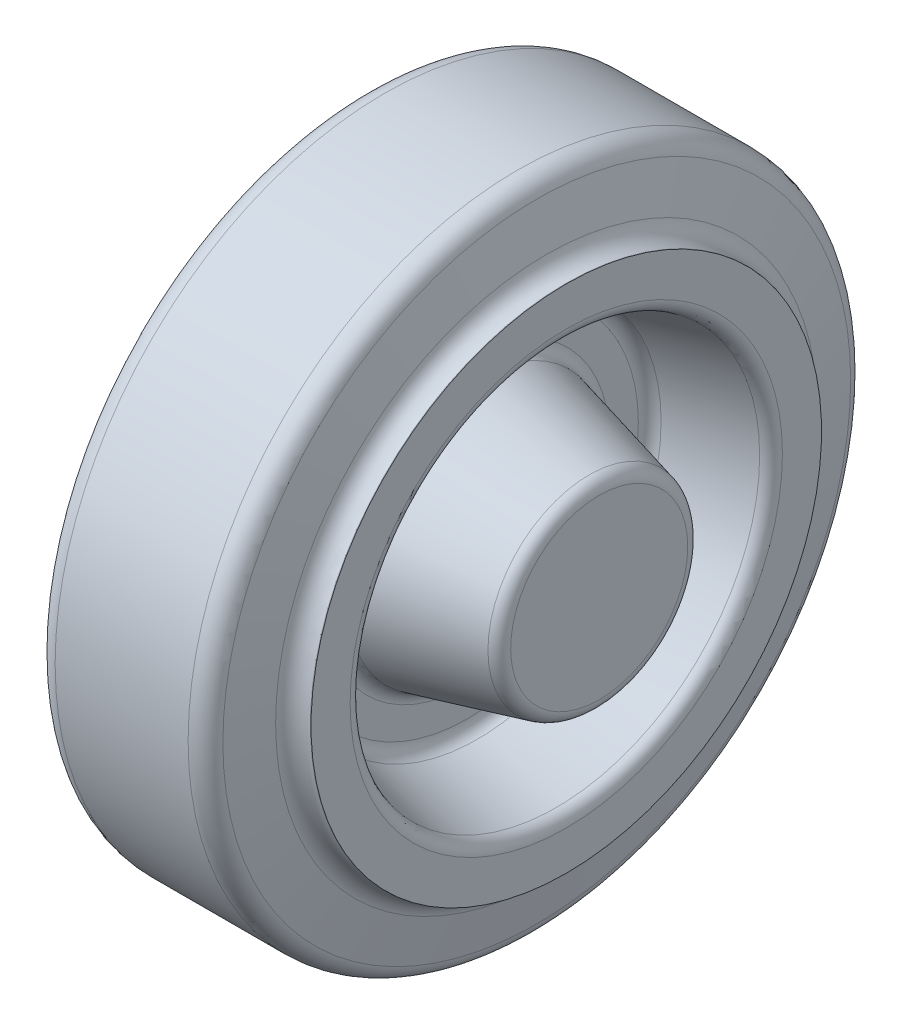
ISO-10303-21;
HEADER;
FILE_DESCRIPTION(('STEP AP214'),'2;1');
FILE_NAME('part.step','',(''),(''),'','','');
FILE_SCHEMA(('AUTOMOTIVE_DESIGN { 1 0 10303 214 1 1 1 1 }'));
ENDSEC;
DATA;
#1=APPLICATION_CONTEXT('core data for automotive mechanical design processes');
#2=APPLICATION_PROTOCOL_DEFINITION('international standard','automotive_design',2000,#1);
#3=PRODUCT_CONTEXT('',#1,'mechanical');
#4=PRODUCT('Part','Part','',(#3));
#5=PRODUCT_RELATED_PRODUCT_CATEGORY('part','',(#4));
#6=PRODUCT_DEFINITION_FORMATION('','',#4);
#7=PRODUCT_DEFINITION_CONTEXT('part definition',#1,'design');
#8=PRODUCT_DEFINITION('design','',#6,#7);
#9=PRODUCT_DEFINITION_SHAPE('','',#8);
#10=(LENGTH_UNIT() NAMED_UNIT(*) SI_UNIT(.MILLI.,.METRE.));
#11=(NAMED_UNIT(*) PLANE_ANGLE_UNIT() SI_UNIT($,.RADIAN.));
#12=(NAMED_UNIT(*) SI_UNIT($,.STERADIAN.) SOLID_ANGLE_UNIT());
#13=UNCERTAINTY_MEASURE_WITH_UNIT(LENGTH_MEASURE(1.E-05),#10,'distance_accuracy_value','');
#14=(GEOMETRIC_REPRESENTATION_CONTEXT(3) GLOBAL_UNCERTAINTY_ASSIGNED_CONTEXT((#13)) GLOBAL_UNIT_ASSIGNED_CONTEXT((#10,
#11,#12)) REPRESENTATION_CONTEXT('',''));
#15=CARTESIAN_POINT('',(0.,0.,0.));
#16=DIRECTION('',(0.,0.,1.));
#17=DIRECTION('',(1.,0.,0.));
#18=AXIS2_PLACEMENT_3D('',#15,#16,#17);
#19=CARTESIAN_POINT('',(-22.4999999999989,-4.44089209850063E-13,0.));
#20=DIRECTION('',(-1.,0.,0.));
#21=DIRECTION('',(0.,-1.,0.));
#22=AXIS2_PLACEMENT_3D('',#19,#20,#21);
#23=PLANE('',#22);
#24=CARTESIAN_POINT('',(-22.5000000000002,-8.88122908548894E-13,1.11022302462516E-13));
#25=DIRECTION('',(1.,0.,0.));
#26=DIRECTION('',(0.,0.,-1.));
#27=AXIS2_PLACEMENT_3D('',#24,#25,#26);
#28=CIRCLE('',#27,13.4384471871913);
#29=CARTESIAN_POINT('',(-22.4999999999997,-5.76108851248636E-13,-13.4384471871911));
#30=VERTEX_POINT('',#29);
#31=CARTESIAN_POINT('',(-22.4999999999997,-7.10509429069363E-13,13.4384471871912));
#32=VERTEX_POINT('',#31);
#33=EDGE_CURVE('E86',#30,#32,#28,.T.);
#34=ORIENTED_EDGE('',*,*,#33,.F.);
#35=CARTESIAN_POINT('',(-22.5000000000002,-8.88122908548894E-13,1.11022302462516E-13));
#36=DIRECTION('',(1.,0.,0.));
#37=DIRECTION('',(0.,0.,1.));
#38=AXIS2_PLACEMENT_3D('',#35,#36,#37);
#39=CIRCLE('',#38,13.438447187191);
#40=EDGE_CURVE('E82',#32,#30,#39,.T.);
#41=ORIENTED_EDGE('',*,*,#40,.F.);
#42=EDGE_LOOP('',(#34,#41));
#43=FACE_BOUND('',#42,.T.);
#44=ADVANCED_FACE('F17',(#43),#23,.T.);
#45=CARTESIAN_POINT('',(22.5000000000001,3.33066907387547E-13,0.));
#46=DIRECTION('',(1.,0.,0.));
#47=DIRECTION('',(0.,1.,0.));
#48=AXIS2_PLACEMENT_3D('',#45,#46,#47);
#49=PLANE('',#48);
#50=CARTESIAN_POINT('',(22.5000000000009,-7.77211628388841E-13,0.));
#51=DIRECTION('',(-1.,0.,0.));
#52=DIRECTION('',(0.,0.,1.));
#53=AXIS2_PLACEMENT_3D('',#50,#51,#52);
#54=CIRCLE('',#53,13.4384471871912);
#55=CARTESIAN_POINT('',(22.5000000000006,-3.88792023770767E-13,13.4384471871912));
#56=VERTEX_POINT('',#55);
#57=CARTESIAN_POINT('',(22.5000000000006,-3.33100214078284E-13,-13.4384471871911));
#58=VERTEX_POINT('',#57);
#59=EDGE_CURVE('E126',#56,#58,#54,.T.);
#60=ORIENTED_EDGE('',*,*,#59,.F.);
#61=CARTESIAN_POINT('',(22.5000000000009,-7.77211628388841E-13,0.));
#62=DIRECTION('',(-1.,0.,0.));
#63=DIRECTION('',(0.,0.,-1.));
#64=AXIS2_PLACEMENT_3D('',#61,#62,#63);
#65=CIRCLE('',#64,13.4384471871911);
#66=EDGE_CURVE('E93',#58,#56,#65,.T.);
#67=ORIENTED_EDGE('',*,*,#66,.F.);
#68=EDGE_LOOP('',(#60,#67));
#69=FACE_BOUND('',#68,.T.);
#70=ADVANCED_FACE('F112',(#69),#49,.T.);
#71=CARTESIAN_POINT('',(-20.5000000000002,-8.88178419700125E-13,1.11022302462516E-13));
#72=DIRECTION('',(-1.,0.,0.));
#73=DIRECTION('',(0.,0.,1.));
#74=AXIS2_PLACEMENT_3D('',#71,#72,#73);
#75=TOROIDAL_SURFACE('',#74,13.4384471871912,2.);
#76=ORIENTED_EDGE('',*,*,#40,.T.);
#77=ORIENTED_EDGE('',*,*,#33,.T.);
#78=EDGE_LOOP('',(#76,#77));
#79=FACE_BOUND('',#78,.T.);
#80=CARTESIAN_POINT('',(-20.9850712500731,0.,0.));
#81=DIRECTION('',(1.,0.,0.));
#82=DIRECTION('',(0.,0.,-1.));
#83=AXIS2_PLACEMENT_3D('',#80,#81,#82);
#84=CIRCLE('',#83,15.3787321874813);
#85=CARTESIAN_POINT('',(-20.9850712500731,0.,-15.3787321874813));
#86=VERTEX_POINT('',#85);
#87=EDGE_CURVE('E121',#86,#86,#84,.T.);
#88=ORIENTED_EDGE('',*,*,#87,.F.);
#89=EDGE_LOOP('',(#88));
#90=FACE_BOUND('',#89,.T.);
#91=ADVANCED_FACE('F91',(#79,#90),#75,.T.);
#92=CARTESIAN_POINT('',(20.5000000000009,-7.7715611723761E-13,0.));
#93=DIRECTION('',(1.,0.,0.));
#94=DIRECTION('',(0.,0.,-1.));
#95=AXIS2_PLACEMENT_3D('',#92,#93,#94);
#96=TOROIDAL_SURFACE('',#95,13.4384471871912,2.);
#97=ORIENTED_EDGE('',*,*,#66,.T.);
#98=ORIENTED_EDGE('',*,*,#59,.T.);
#99=EDGE_LOOP('',(#97,#98));
#100=FACE_BOUND('',#99,.T.);
#101=CARTESIAN_POINT('',(20.985071250073,3.33108955107018E-13,0.));
#102=DIRECTION('',(-1.,0.,0.));
#103=DIRECTION('',(0.,0.,1.));
#104=AXIS2_PLACEMENT_3D('',#101,#102,#103);
#105=CIRCLE('',#104,15.3787321874817);
#106=CARTESIAN_POINT('',(20.985071250073,3.33108955107016E-13,15.3787321874817));
#107=VERTEX_POINT('',#106);
#108=EDGE_CURVE('E163',#107,#107,#105,.T.);
#109=ORIENTED_EDGE('',*,*,#108,.F.);
#110=EDGE_LOOP('',(#109));
#111=FACE_BOUND('',#110,.T.);
#112=ADVANCED_FACE('F111',(#100,#111),#96,.T.);
#113=CARTESIAN_POINT('',(-4.01492874992615,0.,0.));
#114=DIRECTION('',(1.,0.,0.));
#115=DIRECTION('',(0.,1.,0.));
#116=AXIS2_PLACEMENT_3D('',#113,#114,#115);
#117=CONICAL_SURFACE('',#116,19.6212678125181,0.244978663126864);
#118=CARTESIAN_POINT('',(-4.01492874992624,-4.44102673281823E-13,0.));
#119=DIRECTION('',(-1.,0.,0.));
#120=DIRECTION('',(0.,0.,1.));
#121=AXIS2_PLACEMENT_3D('',#118,#119,#120);
#122=CIRCLE('',#121,19.6212678125185);
#123=CARTESIAN_POINT('',(-4.01492874992624,-4.44102673281826E-13,19.6212678125185));
#124=VERTEX_POINT('',#123);
#125=EDGE_CURVE('E167',#124,#124,#122,.T.);
#126=ORIENTED_EDGE('',*,*,#125,.T.);
#127=EDGE_LOOP('',(#126));
#128=FACE_BOUND('',#127,.T.);
#129=ORIENTED_EDGE('',*,*,#87,.T.);
#130=EDGE_LOOP('',(#129));
#131=FACE_BOUND('',#130,.T.);
#132=ADVANCED_FACE('F609',(#128,#131),#117,.T.);
#133=CARTESIAN_POINT('',(4.01492874992791,3.33579971180389E-13,0.));
#134=DIRECTION('',(-1.,0.,0.));
#135=DIRECTION('',(0.,0.,1.));
#136=AXIS2_PLACEMENT_3D('',#133,#134,#135);
#137=CONICAL_SURFACE('',#136,19.621267812518,0.244978663126864);
#138=CARTESIAN_POINT('',(4.01492874992794,-8.88164956268365E-13,0.));
#139=DIRECTION('',(1.,0.,0.));
#140=DIRECTION('',(0.,0.,-1.));
#141=AXIS2_PLACEMENT_3D('',#138,#139,#140);
#142=CIRCLE('',#141,19.621267812518);
#143=CARTESIAN_POINT('',(4.01492874992794,-8.88164956268362E-13,-19.621267812518));
#144=VERTEX_POINT('',#143);
#145=EDGE_CURVE('E172',#144,#144,#142,.T.);
#146=ORIENTED_EDGE('',*,*,#145,.T.);
#147=EDGE_LOOP('',(#146));
#148=FACE_BOUND('',#147,.T.);
#149=ORIENTED_EDGE('',*,*,#108,.T.);
#150=EDGE_LOOP('',(#149));
#151=FACE_BOUND('',#150,.T.);
#152=ADVANCED_FACE('F195',(#148,#151),#137,.T.);
#153=CARTESIAN_POINT('',(-4.50000000000006,-4.44089209850063E-13,0.));
#154=DIRECTION('',(-1.,0.,0.));
#155=DIRECTION('',(0.,0.,1.));
#156=AXIS2_PLACEMENT_3D('',#153,#154,#155);
#157=TOROIDAL_SURFACE('',#156,21.5615528128088,2.);
#158=ORIENTED_EDGE('',*,*,#125,.F.);
#159=EDGE_LOOP('',(#158));
#160=FACE_BOUND('',#159,.T.);
#161=CARTESIAN_POINT('',(-2.50000000000006,-4.44144721001294E-13,0.));
#162=DIRECTION('',(-1.,0.,0.));
#163=DIRECTION('',(0.,0.,-1.));
#164=AXIS2_PLACEMENT_3D('',#161,#162,#163);
#165=CIRCLE('',#164,21.5615528128088);
#166=CARTESIAN_POINT('',(-2.49999999999957,-4.44122516540803E-13,21.5615528128088));
#167=VERTEX_POINT('',#166);
#168=CARTESIAN_POINT('',(-2.49999999999957,-2.45815260345482E-13,-21.5615528128088));
#169=VERTEX_POINT('',#168);
#170=EDGE_CURVE('E178',#167,#169,#165,.F.);
#171=ORIENTED_EDGE('',*,*,#170,.F.);
#172=CARTESIAN_POINT('',(-2.50000000000006,-4.44144721001294E-13,0.));
#173=DIRECTION('',(-1.,0.,0.));
#174=DIRECTION('',(0.,0.,1.));
#175=AXIS2_PLACEMENT_3D('',#172,#173,#174);
#176=CIRCLE('',#175,21.5615528128088);
#177=EDGE_CURVE('E333',#169,#167,#176,.F.);
#178=ORIENTED_EDGE('',*,*,#177,.F.);
#179=EDGE_LOOP('',(#171,#178));
#180=FACE_BOUND('',#179,.T.);
#181=ADVANCED_FACE('F184',(#160,#180),#157,.F.);
#182=CARTESIAN_POINT('',(4.49999999999984,-8.88178419700125E-13,0.));
#183=DIRECTION('',(1.,0.,0.));
#184=DIRECTION('',(0.,0.,-1.));
#185=AXIS2_PLACEMENT_3D('',#182,#183,#184);
#186=TOROIDAL_SURFACE('',#185,21.5615528128088,2.);
#187=ORIENTED_EDGE('',*,*,#145,.F.);
#188=EDGE_LOOP('',(#187));
#189=FACE_BOUND('',#188,.T.);
#190=CARTESIAN_POINT('',(2.49999999999984,-8.88122908548894E-13,0.));
#191=DIRECTION('',(1.,0.,0.));
#192=DIRECTION('',(0.,0.,1.));
#193=AXIS2_PLACEMENT_3D('',#190,#191,#192);
#194=CIRCLE('',#193,21.5615528128088);
#195=CARTESIAN_POINT('',(2.50000000000013,-8.88145113009385E-13,-21.5615528128088));
#196=VERTEX_POINT('',#195);
#197=CARTESIAN_POINT('',(2.50000000000013,-3.48958851730679E-13,21.5615528128088));
#198=VERTEX_POINT('',#197);
#199=EDGE_CURVE('E248',#196,#198,#194,.F.);
#200=ORIENTED_EDGE('',*,*,#199,.F.);
#201=CARTESIAN_POINT('',(2.49999999999984,-8.88122908548894E-13,0.));
#202=DIRECTION('',(1.,0.,0.));
#203=DIRECTION('',(0.,0.,-1.));
#204=AXIS2_PLACEMENT_3D('',#201,#202,#203);
#205=CIRCLE('',#204,21.5615528128088);
#206=EDGE_CURVE('E213',#198,#196,#205,.F.);
#207=ORIENTED_EDGE('',*,*,#206,.F.);
#208=EDGE_LOOP('',(#200,#207));
#209=FACE_BOUND('',#208,.T.);
#210=ADVANCED_FACE('F194',(#189,#209),#186,.F.);
#211=CARTESIAN_POINT('',(-2.49999999999884,19.9999999999991,-1.11022302462516E-13));
#212=DIRECTION('',(-1.,0.,0.));
#213=DIRECTION('',(0.,-1.,0.));
#214=AXIS2_PLACEMENT_3D('',#211,#212,#213);
#215=PLANE('',#214);
#216=ORIENTED_EDGE('',*,*,#170,.T.);
#217=ORIENTED_EDGE('',*,*,#177,.T.);
#218=EDGE_LOOP('',(#216,#217));
#219=FACE_BOUND('',#218,.T.);
#220=CARTESIAN_POINT('',(-2.50000000000006,-4.44144721001294E-13,0.));
#221=DIRECTION('',(1.,0.,0.));
#222=DIRECTION('',(0.,0.,-1.));
#223=AXIS2_PLACEMENT_3D('',#220,#221,#222);
#224=CIRCLE('',#223,25.938447187191);
#225=CARTESIAN_POINT('',(-2.49999999999957,-2.66486832600778E-13,25.9384471871911));
#226=VERTEX_POINT('',#225);
#227=CARTESIAN_POINT('',(-2.49999999999957,-4.40828811580659E-13,-25.9384471871911));
#228=VERTEX_POINT('',#227);
#229=EDGE_CURVE('E301',#226,#228,#224,.F.);
#230=ORIENTED_EDGE('',*,*,#229,.T.);
#231=CARTESIAN_POINT('',(-2.50000000000006,-4.44144721001294E-13,0.));
#232=DIRECTION('',(1.,0.,0.));
#233=DIRECTION('',(0.,0.,1.));
#234=AXIS2_PLACEMENT_3D('',#231,#232,#233);
#235=CIRCLE('',#234,25.9384471871912);
#236=EDGE_CURVE('E342',#228,#226,#235,.F.);
#237=ORIENTED_EDGE('',*,*,#236,.T.);
#238=EDGE_LOOP('',(#230,#237));
#239=FACE_BOUND('',#238,.T.);
#240=ADVANCED_FACE('F307',(#219,#239),#215,.T.);
#241=CARTESIAN_POINT('',(2.50000000000056,19.9999999999984,0.));
#242=DIRECTION('',(1.,0.,0.));
#243=DIRECTION('',(0.,1.,0.));
#244=AXIS2_PLACEMENT_3D('',#241,#242,#243);
#245=PLANE('',#244);
#246=CARTESIAN_POINT('',(2.49999999999984,-8.88122908548894E-13,0.));
#247=DIRECTION('',(-1.,0.,0.));
#248=DIRECTION('',(0.,0.,1.));
#249=AXIS2_PLACEMENT_3D('',#246,#247,#248);
#250=CIRCLE('',#249,25.938447187191);
#251=CARTESIAN_POINT('',(2.50000000000013,-7.10509429069359E-13,-25.9384471871911));
#252=VERTEX_POINT('',#251);
#253=CARTESIAN_POINT('',(2.50000000000013,-8.84851408049248E-13,25.9384471871911));
#254=VERTEX_POINT('',#253);
#255=EDGE_CURVE('E269',#252,#254,#250,.F.);
#256=ORIENTED_EDGE('',*,*,#255,.T.);
#257=CARTESIAN_POINT('',(2.49999999999984,-8.88122908548894E-13,0.));
#258=DIRECTION('',(-1.,0.,0.));
#259=DIRECTION('',(0.,0.,-1.));
#260=AXIS2_PLACEMENT_3D('',#257,#258,#259);
#261=CIRCLE('',#260,25.9384471871912);
#262=EDGE_CURVE('E280',#254,#252,#261,.F.);
#263=ORIENTED_EDGE('',*,*,#262,.T.);
#264=EDGE_LOOP('',(#256,#263));
#265=FACE_BOUND('',#264,.T.);
#266=ORIENTED_EDGE('',*,*,#199,.T.);
#267=ORIENTED_EDGE('',*,*,#206,.T.);
#268=EDGE_LOOP('',(#266,#267));
#269=FACE_BOUND('',#268,.T.);
#270=ADVANCED_FACE('F235',(#265,#269),#245,.T.);
#271=CARTESIAN_POINT('',(-4.50000000000006,-4.44089209850063E-13,0.));
#272=DIRECTION('',(-1.,0.,0.));
#273=DIRECTION('',(0.,0.,1.));
#274=AXIS2_PLACEMENT_3D('',#271,#272,#273);
#275=TOROIDAL_SURFACE('',#274,25.9384471871912,2.);
#276=ORIENTED_EDGE('',*,*,#229,.F.);
#277=ORIENTED_EDGE('',*,*,#236,.F.);
#278=EDGE_LOOP('',(#276,#277));
#279=FACE_BOUND('',#278,.T.);
#280=CARTESIAN_POINT('',(-4.01492874992614,-4.44463495764826E-13,1.11022302462515E-13));
#281=DIRECTION('',(-1.,0.,0.));
#282=DIRECTION('',(0.,0.,1.));
#283=AXIS2_PLACEMENT_3D('',#280,#281,#282);
#284=CIRCLE('',#283,27.8787321874817);
#285=CARTESIAN_POINT('',(-4.01492874992613,-4.4446349576483E-13,27.8787321874818));
#286=VERTEX_POINT('',#285);
#287=EDGE_CURVE('E245',#286,#286,#284,.T.);
#288=ORIENTED_EDGE('',*,*,#287,.T.);
#289=EDGE_LOOP('',(#288));
#290=FACE_BOUND('',#289,.T.);
#291=ADVANCED_FACE('F223',(#279,#290),#275,.F.);
#292=CARTESIAN_POINT('',(4.49999999999984,-8.88178419700125E-13,0.));
#293=DIRECTION('',(1.,0.,0.));
#294=DIRECTION('',(0.,0.,-1.));
#295=AXIS2_PLACEMENT_3D('',#292,#293,#294);
#296=TOROIDAL_SURFACE('',#295,25.9384471871912,2.);
#297=ORIENTED_EDGE('',*,*,#255,.F.);
#298=ORIENTED_EDGE('',*,*,#262,.F.);
#299=EDGE_LOOP('',(#297,#298));
#300=FACE_BOUND('',#299,.T.);
#301=CARTESIAN_POINT('',(4.01492874992791,-4.44131257569533E-13,0.));
#302=DIRECTION('',(1.,0.,0.));
#303=DIRECTION('',(0.,0.,-1.));
#304=AXIS2_PLACEMENT_3D('',#301,#302,#303);
#305=CIRCLE('',#304,27.8787321874818);
#306=CARTESIAN_POINT('',(4.01492874992791,-4.4413125756953E-13,-27.8787321874818));
#307=VERTEX_POINT('',#306);
#308=EDGE_CURVE('E344',#307,#307,#305,.T.);
#309=ORIENTED_EDGE('',*,*,#308,.T.);
#310=EDGE_LOOP('',(#309));
#311=FACE_BOUND('',#310,.T.);
#312=ADVANCED_FACE('F234',(#300,#311),#296,.F.);
#313=CARTESIAN_POINT('',(-15.9850712500731,-4.44131257569533E-13,1.11022302462516E-13));
#314=DIRECTION('',(-1.,0.,0.));
#315=DIRECTION('',(0.,0.,1.));
#316=AXIS2_PLACEMENT_3D('',#313,#314,#315);
#317=CONICAL_SURFACE('',#316,30.8712678125184,0.244978663126864);
#318=ORIENTED_EDGE('',*,*,#287,.F.);
#319=EDGE_LOOP('',(#318));
#320=FACE_BOUND('',#319,.T.);
#321=CARTESIAN_POINT('',(-15.9850712500731,-8.88164956268365E-13,1.11022302462516E-13));
#322=DIRECTION('',(-1.,0.,0.));
#323=DIRECTION('',(0.,0.,1.));
#324=AXIS2_PLACEMENT_3D('',#321,#322,#323);
#325=CIRCLE('',#324,30.8712678125183);
#326=CARTESIAN_POINT('',(-15.9850712500731,-8.88164956268369E-13,30.8712678125184));
#327=VERTEX_POINT('',#326);
#328=EDGE_CURVE('E348',#327,#327,#325,.F.);
#329=ORIENTED_EDGE('',*,*,#328,.F.);
#330=EDGE_LOOP('',(#329));
#331=FACE_BOUND('',#330,.T.);
#332=ADVANCED_FACE('F728',(#320,#331),#317,.F.);
#333=CARTESIAN_POINT('',(15.985071250073,-4.44463495764826E-13,0.));
#334=DIRECTION('',(1.,0.,0.));
#335=DIRECTION('',(0.,0.,-1.));
#336=AXIS2_PLACEMENT_3D('',#333,#334,#335);
#337=CONICAL_SURFACE('',#336,30.871267812518,0.244978663126864);
#338=ORIENTED_EDGE('',*,*,#308,.F.);
#339=EDGE_LOOP('',(#338));
#340=FACE_BOUND('',#339,.T.);
#341=CARTESIAN_POINT('',(15.985071250073,0.,0.));
#342=DIRECTION('',(1.,0.,0.));
#343=DIRECTION('',(0.,0.,-1.));
#344=AXIS2_PLACEMENT_3D('',#341,#342,#343);
#345=CIRCLE('',#344,30.8712678125181);
#346=CARTESIAN_POINT('',(15.985071250073,0.,-30.8712678125181));
#347=VERTEX_POINT('',#346);
#348=EDGE_CURVE('E353',#347,#347,#345,.F.);
#349=ORIENTED_EDGE('',*,*,#348,.F.);
#350=EDGE_LOOP('',(#349));
#351=FACE_BOUND('',#350,.T.);
#352=ADVANCED_FACE('F376',(#340,#351),#337,.F.);
#353=CARTESIAN_POINT('',(-15.5,-8.88178419700125E-13,1.11022302462516E-13));
#354=DIRECTION('',(-1.,0.,0.));
#355=DIRECTION('',(0.,0.,1.));
#356=AXIS2_PLACEMENT_3D('',#353,#354,#355);
#357=TOROIDAL_SURFACE('',#356,32.8115528128088,2.);
#358=ORIENTED_EDGE('',*,*,#328,.T.);
#359=EDGE_LOOP('',(#358));
#360=FACE_BOUND('',#359,.T.);
#361=CARTESIAN_POINT('',(-17.5,-8.88122908548894E-13,1.11022302462516E-13));
#362=DIRECTION('',(-1.,0.,0.));
#363=DIRECTION('',(0.,0.,1.));
#364=AXIS2_PLACEMENT_3D('',#361,#362,#363);
#365=CIRCLE('',#364,32.8115528128087);
#366=CARTESIAN_POINT('',(-17.5,-7.91090338440366E-13,-32.8115528128086));
#367=VERTEX_POINT('',#366);
#368=CARTESIAN_POINT('',(-17.5,-8.88145113009389E-13,32.8115528128088));
#369=VERTEX_POINT('',#368);
#370=EDGE_CURVE('E793',#367,#369,#365,.F.);
#371=ORIENTED_EDGE('',*,*,#370,.F.);
#372=CARTESIAN_POINT('',(-17.5,-8.88122908548894E-13,1.11022302462516E-13));
#373=DIRECTION('',(-1.,0.,0.));
#374=DIRECTION('',(0.,0.,-1.));
#375=AXIS2_PLACEMENT_3D('',#372,#373,#374);
#376=CIRCLE('',#375,32.8115528128087);
#377=EDGE_CURVE('E359',#369,#367,#376,.F.);
#378=ORIENTED_EDGE('',*,*,#377,.F.);
#379=EDGE_LOOP('',(#371,#378));
#380=FACE_BOUND('',#379,.T.);
#381=ADVANCED_FACE('F365',(#360,#380),#357,.T.);
#382=CARTESIAN_POINT('',(15.5000000000006,0.,0.));
#383=DIRECTION('',(1.,0.,0.));
#384=DIRECTION('',(0.,0.,-1.));
#385=AXIS2_PLACEMENT_3D('',#382,#383,#384);
#386=TOROIDAL_SURFACE('',#385,32.8115528128088,2.);
#387=ORIENTED_EDGE('',*,*,#348,.T.);
#388=EDGE_LOOP('',(#387));
#389=FACE_BOUND('',#388,.T.);
#390=CARTESIAN_POINT('',(17.5000000000006,0.,0.));
#391=DIRECTION('',(1.,0.,0.));
#392=DIRECTION('',(0.,0.,-1.));
#393=AXIS2_PLACEMENT_3D('',#390,#391,#392);
#394=CIRCLE('',#393,32.8115528128087);
#395=CARTESIAN_POINT('',(17.5000000000005,0.,32.8115528128087));
#396=VERTEX_POINT('',#395);
#397=CARTESIAN_POINT('',(17.5000000000005,0.,-32.8115528128087));
#398=VERTEX_POINT('',#397);
#399=EDGE_CURVE('E37',#396,#398,#394,.F.);
#400=ORIENTED_EDGE('',*,*,#399,.F.);
#401=CARTESIAN_POINT('',(17.5000000000006,0.,0.));
#402=DIRECTION('',(1.,0.,0.));
#403=DIRECTION('',(0.,0.,1.));
#404=AXIS2_PLACEMENT_3D('',#401,#402,#403);
#405=CIRCLE('',#404,32.8115528128087);
#406=EDGE_CURVE('E451',#398,#396,#405,.F.);
#407=ORIENTED_EDGE('',*,*,#406,.F.);
#408=EDGE_LOOP('',(#400,#407));
#409=FACE_BOUND('',#408,.T.);
#410=ADVANCED_FACE('F375',(#389,#409),#386,.T.);
#411=CARTESIAN_POINT('',(-17.5000000000001,31.2499999999989,-1.66533453693773E-13));
#412=DIRECTION('',(-1.,0.,0.));
#413=DIRECTION('',(0.,-1.,0.));
#414=AXIS2_PLACEMENT_3D('',#411,#412,#413);
#415=PLANE('',#414);
#416=CARTESIAN_POINT('',(-17.4999999999988,0.,0.));
#417=DIRECTION('',(1.,0.,0.));
#418=DIRECTION('',(0.,1.,0.));
#419=AXIS2_PLACEMENT_3D('',#416,#417,#418);
#420=CIRCLE('',#419,38.7499999999998);
#421=CARTESIAN_POINT('',(-17.4999999999988,38.7499999999998,0.));
#422=VERTEX_POINT('',#421);
#423=EDGE_CURVE('E537',#422,#422,#420,.T.);
#424=ORIENTED_EDGE('',*,*,#423,.F.);
#425=EDGE_LOOP('',(#424));
#426=FACE_BOUND('',#425,.T.);
#427=ORIENTED_EDGE('',*,*,#377,.T.);
#428=ORIENTED_EDGE('',*,*,#370,.T.);
#429=EDGE_LOOP('',(#427,#428));
#430=FACE_BOUND('',#429,.T.);
#431=ADVANCED_FACE('F404',(#426,#430),#415,.T.);
#432=CARTESIAN_POINT('',(17.5000000000003,31.2499999999993,0.));
#433=DIRECTION('',(1.,0.,0.));
#434=DIRECTION('',(0.,1.,0.));
#435=AXIS2_PLACEMENT_3D('',#432,#433,#434);
#436=PLANE('',#435);
#437=CARTESIAN_POINT('',(17.5000000000002,0.,0.));
#438=DIRECTION('',(1.,0.,0.));
#439=DIRECTION('',(0.,1.,0.));
#440=AXIS2_PLACEMENT_3D('',#437,#438,#439);
#441=CIRCLE('',#440,38.7499999999998);
#442=CARTESIAN_POINT('',(17.5000000000002,38.7499999999998,0.));
#443=VERTEX_POINT('',#442);
#444=EDGE_CURVE('E100',#443,#443,#441,.F.);
#445=ORIENTED_EDGE('',*,*,#444,.F.);
#446=EDGE_LOOP('',(#445));
#447=FACE_BOUND('',#446,.T.);
#448=ORIENTED_EDGE('',*,*,#406,.T.);
#449=ORIENTED_EDGE('',*,*,#399,.T.);
#450=EDGE_LOOP('',(#448,#449));
#451=FACE_BOUND('',#450,.T.);
#452=ADVANCED_FACE('F413',(#447,#451),#436,.T.);
#453=CARTESIAN_POINT('',(0.,0.,0.));
#454=DIRECTION('',(1.,0.,0.));
#455=DIRECTION('',(0.,1.,0.));
#456=AXIS2_PLACEMENT_3D('',#453,#454,#455);
#457=CYLINDRICAL_SURFACE('',#456,38.7499999999998);
#458=ORIENTED_EDGE('',*,*,#423,.T.);
#459=EDGE_LOOP('',(#458));
#460=FACE_BOUND('',#459,.T.);
#461=CARTESIAN_POINT('',(-17.4065148190978,-7.7715611723761E-13,1.11022302462516E-13));
#462=DIRECTION('',(1.,0.,0.));
#463=DIRECTION('',(0.,0.,-1.));
#464=AXIS2_PLACEMENT_3D('',#461,#462,#463);
#465=CIRCLE('',#464,38.75);
#466=CARTESIAN_POINT('',(-17.4065148190978,-7.77156117237604E-13,-38.7499999999999));
#467=VERTEX_POINT('',#466);
#468=EDGE_CURVE('E395',#467,#467,#465,.F.);
#469=ORIENTED_EDGE('',*,*,#468,.T.);
#470=EDGE_LOOP('',(#469));
#471=FACE_BOUND('',#470,.T.);
#472=ADVANCED_FACE('F466',(#460,#471),#457,.T.);
#473=CARTESIAN_POINT('',(0.,0.,0.));
#474=DIRECTION('',(1.,0.,0.));
#475=DIRECTION('',(0.,1.,0.));
#476=AXIS2_PLACEMENT_3D('',#473,#474,#475);
#477=CYLINDRICAL_SURFACE('',#476,38.7499999999998);
#478=CARTESIAN_POINT('',(17.4065148190981,-1.22124532708767E-12,0.));
#479=DIRECTION('',(1.,0.,0.));
#480=DIRECTION('',(0.,0.,-1.));
#481=AXIS2_PLACEMENT_3D('',#478,#479,#480);
#482=CIRCLE('',#481,38.75);
#483=CARTESIAN_POINT('',(17.4065148190981,-1.22124532708767E-12,-38.75));
#484=VERTEX_POINT('',#483);
#485=EDGE_CURVE('E398',#484,#484,#482,.T.);
#486=ORIENTED_EDGE('',*,*,#485,.T.);
#487=EDGE_LOOP('',(#486));
#488=FACE_BOUND('',#487,.T.);
#489=ORIENTED_EDGE('',*,*,#444,.T.);
#490=EDGE_LOOP('',(#489));
#491=FACE_BOUND('',#490,.T.);
#492=ADVANCED_FACE('F462',(#488,#491),#477,.T.);
#493=CARTESIAN_POINT('',(-17.4065148190978,-7.7715611723761E-13,1.11022302462516E-13));
#494=DIRECTION('',(1.,0.,0.));
#495=DIRECTION('',(0.,0.,-1.));
#496=AXIS2_PLACEMENT_3D('',#493,#494,#495);
#497=TOROIDAL_SURFACE('',#496,41.75,3.);
#498=ORIENTED_EDGE('',*,*,#468,.F.);
#499=EDGE_LOOP('',(#498));
#500=FACE_BOUND('',#499,.T.);
#501=CARTESIAN_POINT('',(-14.4779536385451,0.,0.));
#502=DIRECTION('',(1.,0.,0.));
#503=DIRECTION('',(0.,0.,-1.));
#504=AXIS2_PLACEMENT_3D('',#501,#502,#503);
#505=CIRCLE('',#504,41.0992086265441);
#506=CARTESIAN_POINT('',(-14.4779536385451,0.,-41.0992086265441));
#507=VERTEX_POINT('',#506);
#508=EDGE_CURVE('E431',#507,#507,#505,.T.);
#509=ORIENTED_EDGE('',*,*,#508,.F.);
#510=EDGE_LOOP('',(#509));
#511=FACE_BOUND('',#510,.T.);
#512=ADVANCED_FACE('F457',(#500,#511),#497,.F.);
#513=CARTESIAN_POINT('',(17.4065148190981,-1.22124532708767E-12,0.));
#514=DIRECTION('',(1.,0.,0.));
#515=DIRECTION('',(0.,0.,-1.));
#516=AXIS2_PLACEMENT_3D('',#513,#514,#515);
#517=TOROIDAL_SURFACE('',#516,41.75,3.);
#518=CARTESIAN_POINT('',(14.4779536385463,-7.77141627540349E-13,0.));
#519=DIRECTION('',(-1.,0.,0.));
#520=DIRECTION('',(0.,0.,1.));
#521=AXIS2_PLACEMENT_3D('',#518,#519,#520);
#522=CIRCLE('',#521,41.0992086265441);
#523=CARTESIAN_POINT('',(14.4779536385463,-7.77141627540355E-13,41.0992086265441));
#524=VERTEX_POINT('',#523);
#525=EDGE_CURVE('E504',#524,#524,#522,.T.);
#526=ORIENTED_EDGE('',*,*,#525,.F.);
#527=EDGE_LOOP('',(#526));
#528=FACE_BOUND('',#527,.T.);
#529=ORIENTED_EDGE('',*,*,#485,.F.);
#530=EDGE_LOOP('',(#529));
#531=FACE_BOUND('',#530,.T.);
#532=ADVANCED_FACE('F461',(#528,#531),#517,.F.);
#533=CARTESIAN_POINT('',(-13.022046361453,0.,0.));
#534=DIRECTION('',(1.,0.,0.));
#535=DIRECTION('',(0.,1.,0.));
#536=AXIS2_PLACEMENT_3D('',#533,#534,#535);
#537=CONICAL_SURFACE('',#536,47.6507913734587,1.35212738092095);
#538=ORIENTED_EDGE('',*,*,#508,.T.);
#539=EDGE_LOOP('',(#538));
#540=FACE_BOUND('',#539,.T.);
#541=CARTESIAN_POINT('',(-13.0220463614527,-4.44007925948771E-13,0.));
#542=DIRECTION('',(-1.,0.,0.));
#543=DIRECTION('',(0.,0.,1.));
#544=AXIS2_PLACEMENT_3D('',#541,#542,#543);
#545=CIRCLE('',#544,47.6507913734586);
#546=CARTESIAN_POINT('',(-13.0220463614527,-4.44007925948777E-13,47.6507913734586));
#547=VERTEX_POINT('',#546);
#548=EDGE_CURVE('E499',#547,#547,#545,.F.);
#549=ORIENTED_EDGE('',*,*,#548,.F.);
#550=EDGE_LOOP('',(#549));
#551=FACE_BOUND('',#550,.T.);
#552=ADVANCED_FACE('F509',(#540,#551),#537,.T.);
#553=CARTESIAN_POINT('',(13.0220463614549,-7.77101217995831E-13,0.));
#554=DIRECTION('',(-1.,0.,0.));
#555=DIRECTION('',(0.,-1.,0.));
#556=AXIS2_PLACEMENT_3D('',#553,#554,#555);
#557=CONICAL_SURFACE('',#556,47.6507913734553,1.35212738092095);
#558=ORIENTED_EDGE('',*,*,#525,.T.);
#559=EDGE_LOOP('',(#558));
#560=FACE_BOUND('',#559,.T.);
#561=CARTESIAN_POINT('',(13.022046361455,1.10941018561224E-13,0.));
#562=DIRECTION('',(-1.,0.,0.));
#563=DIRECTION('',(0.,0.,1.));
#564=AXIS2_PLACEMENT_3D('',#561,#562,#563);
#565=CIRCLE('',#564,47.6507913734554);
#566=CARTESIAN_POINT('',(13.022046361455,1.10941018561217E-13,47.6507913734554));
#567=VERTEX_POINT('',#566);
#568=EDGE_CURVE('E497',#567,#567,#565,.T.);
#569=ORIENTED_EDGE('',*,*,#568,.F.);
#570=EDGE_LOOP('',(#569));
#571=FACE_BOUND('',#570,.T.);
#572=ADVANCED_FACE('F513',(#560,#571),#557,.T.);
#573=CARTESIAN_POINT('',(-10.0934851809014,-4.44089209850063E-13,0.));
#574=DIRECTION('',(-1.,0.,0.));
#575=DIRECTION('',(0.,0.,1.));
#576=AXIS2_PLACEMENT_3D('',#573,#574,#575);
#577=TOROIDAL_SURFACE('',#576,47.,3.);
#578=CARTESIAN_POINT('',(-10.0934851809014,0.,0.));
#579=DIRECTION('',(1.,0.,0.));
#580=DIRECTION('',(0.,1.,0.));
#581=AXIS2_PLACEMENT_3D('',#578,#579,#580);
#582=CIRCLE('',#581,49.9999999999998);
#583=CARTESIAN_POINT('',(-10.0934851809014,49.9999999999998,0.));
#584=VERTEX_POINT('',#583);
#585=EDGE_CURVE('E29',#584,#584,#582,.T.);
#586=ORIENTED_EDGE('',*,*,#585,.F.);
#587=EDGE_LOOP('',(#586));
#588=FACE_BOUND('',#587,.T.);
#589=ORIENTED_EDGE('',*,*,#548,.T.);
#590=EDGE_LOOP('',(#589));
#591=FACE_BOUND('',#590,.T.);
#592=ADVANCED_FACE('F485',(#588,#591),#577,.T.);
#593=CARTESIAN_POINT('',(10.093485180903,1.11022302462516E-13,0.));
#594=DIRECTION('',(-1.,0.,0.));
#595=DIRECTION('',(0.,0.,1.));
#596=AXIS2_PLACEMENT_3D('',#593,#594,#595);
#597=TOROIDAL_SURFACE('',#596,47.,3.);
#598=ORIENTED_EDGE('',*,*,#568,.T.);
#599=EDGE_LOOP('',(#598));
#600=FACE_BOUND('',#599,.T.);
#601=CARTESIAN_POINT('',(10.093485180903,0.,0.));
#602=DIRECTION('',(1.,0.,0.));
#603=DIRECTION('',(0.,1.,0.));
#604=AXIS2_PLACEMENT_3D('',#601,#602,#603);
#605=CIRCLE('',#604,49.9999999999998);
#606=CARTESIAN_POINT('',(10.093485180903,49.9999999999998,0.));
#607=VERTEX_POINT('',#606);
#608=EDGE_CURVE('E11',#607,#607,#605,.F.);
#609=ORIENTED_EDGE('',*,*,#608,.F.);
#610=EDGE_LOOP('',(#609));
#611=FACE_BOUND('',#610,.T.);
#612=ADVANCED_FACE('F479',(#600,#611),#597,.T.);
#613=CARTESIAN_POINT('',(0.,0.,0.));
#614=DIRECTION('',(1.,0.,0.));
#615=DIRECTION('',(0.,1.,0.));
#616=AXIS2_PLACEMENT_3D('',#613,#614,#615);
#617=CYLINDRICAL_SURFACE('',#616,49.9999999999998);
#618=ORIENTED_EDGE('',*,*,#585,.T.);
#619=EDGE_LOOP('',(#618));
#620=FACE_BOUND('',#619,.T.);
#621=ORIENTED_EDGE('',*,*,#608,.T.);
#622=EDGE_LOOP('',(#621));
#623=FACE_BOUND('',#622,.T.);
#624=ADVANCED_FACE('F477',(#620,#623),#617,.T.);
#625=CLOSED_SHELL('',(#44,#70,#91,#112,#132,#152,#181,#210,#240,#270,#291,#312,#332,#352,#381,
#410,#431,#452,#472,#492,#512,#532,#552,#572,#592,#612,#624));
#626=MANIFOLD_SOLID_BREP('B1',#625);
#627=ADVANCED_BREP_SHAPE_REPRESENTATION('',(#18,#626),#14);
#628=SHAPE_DEFINITION_REPRESENTATION(#9,#627);
ENDSEC;
END-ISO-10303-21;
